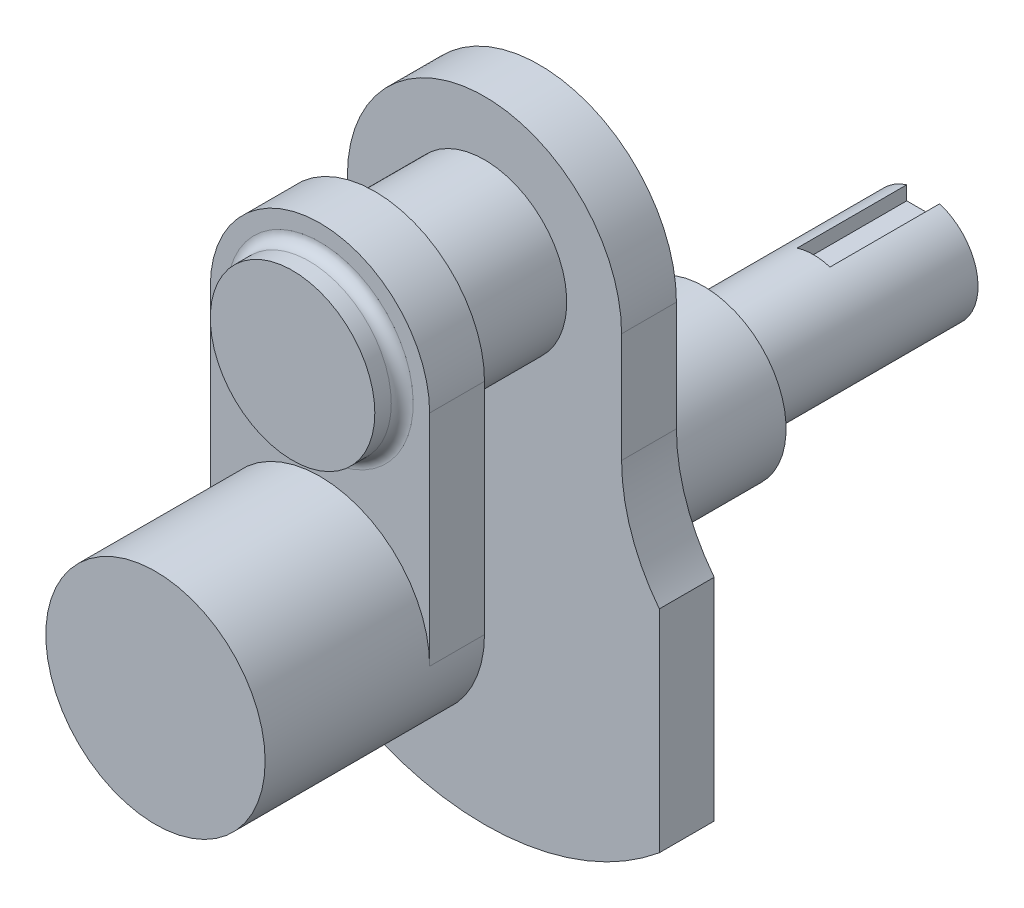
ISO-10303-21;
HEADER;
FILE_DESCRIPTION(('STEP AP214'),'2;1');
FILE_NAME('part.step','',(''),(''),'','','');
FILE_SCHEMA(('AUTOMOTIVE_DESIGN { 1 0 10303 214 1 1 1 1 }'));
ENDSEC;
DATA;
#1=APPLICATION_CONTEXT('core data for automotive mechanical design processes');
#2=APPLICATION_PROTOCOL_DEFINITION('international standard','automotive_design',2000,#1);
#3=PRODUCT_CONTEXT('',#1,'mechanical');
#4=PRODUCT('Part','Part','',(#3));
#5=PRODUCT_RELATED_PRODUCT_CATEGORY('part','',(#4));
#6=PRODUCT_DEFINITION_FORMATION('','',#4);
#7=PRODUCT_DEFINITION_CONTEXT('part definition',#1,'design');
#8=PRODUCT_DEFINITION('design','',#6,#7);
#9=PRODUCT_DEFINITION_SHAPE('','',#8);
#10=(LENGTH_UNIT() NAMED_UNIT(*) SI_UNIT(.MILLI.,.METRE.));
#11=(NAMED_UNIT(*) PLANE_ANGLE_UNIT() SI_UNIT($,.RADIAN.));
#12=(NAMED_UNIT(*) SI_UNIT($,.STERADIAN.) SOLID_ANGLE_UNIT());
#13=UNCERTAINTY_MEASURE_WITH_UNIT(LENGTH_MEASURE(1.E-05),#10,'distance_accuracy_value','');
#14=(GEOMETRIC_REPRESENTATION_CONTEXT(3) GLOBAL_UNCERTAINTY_ASSIGNED_CONTEXT((#13)) GLOBAL_UNIT_ASSIGNED_CONTEXT((#10,
#11,#12)) REPRESENTATION_CONTEXT('',''));
#15=CARTESIAN_POINT('',(0.,0.,0.));
#16=DIRECTION('',(0.,0.,1.));
#17=DIRECTION('',(1.,0.,0.));
#18=AXIS2_PLACEMENT_3D('',#15,#16,#17);
#19=CARTESIAN_POINT('',(-20.,20.,-120.));
#20=DIRECTION('',(0.,0.,1.));
#21=DIRECTION('',(1.,0.,0.));
#22=AXIS2_PLACEMENT_3D('',#19,#20,#21);
#23=CYLINDRICAL_SURFACE('',#22,10.);
#24=CARTESIAN_POINT('',(-20.,20.,-82.));
#25=DIRECTION('',(0.,0.,-1.));
#26=DIRECTION('',(-1.,0.,0.));
#27=AXIS2_PLACEMENT_3D('',#24,#25,#26);
#28=CIRCLE('',#27,10.);
#29=CARTESIAN_POINT('',(-30.,20.,-82.));
#30=VERTEX_POINT('',#29);
#31=EDGE_CURVE('E92',#30,#30,#28,.T.);
#32=ORIENTED_EDGE('',*,*,#31,.T.);
#33=EDGE_LOOP('',(#32));
#34=FACE_BOUND('',#33,.T.);
#35=DIRECTION('',(0.,0.,-1.));
#36=VECTOR('',#35,1.);
#37=CARTESIAN_POINT('',(-17.,29.5393920141695,-100.));
#38=LINE('',#37,#36);
#39=CARTESIAN_POINT('',(-17.,29.5393920141695,-100.));
#40=VERTEX_POINT('',#39);
#41=CARTESIAN_POINT('',(-17.,29.5393920141695,-120.));
#42=VERTEX_POINT('',#41);
#43=EDGE_CURVE('E238',#40,#42,#38,.T.);
#44=ORIENTED_EDGE('',*,*,#43,.F.);
#45=CARTESIAN_POINT('',(-20.,20.,-100.));
#46=DIRECTION('',(0.,0.,-1.));
#47=DIRECTION('',(-1.,0.,0.));
#48=AXIS2_PLACEMENT_3D('',#45,#46,#47);
#49=CIRCLE('',#48,10.);
#50=CARTESIAN_POINT('',(-23.,29.5393920141695,-100.));
#51=VERTEX_POINT('',#50);
#52=EDGE_CURVE('E214',#51,#40,#49,.T.);
#53=ORIENTED_EDGE('',*,*,#52,.F.);
#54=DIRECTION('',(0.,0.,-1.));
#55=VECTOR('',#54,1.);
#56=CARTESIAN_POINT('',(-23.,29.5393920141695,-100.));
#57=LINE('',#56,#55);
#58=CARTESIAN_POINT('',(-23.,29.5393920141695,-120.));
#59=VERTEX_POINT('',#58);
#60=EDGE_CURVE('E203',#51,#59,#57,.T.);
#61=ORIENTED_EDGE('',*,*,#60,.T.);
#62=CARTESIAN_POINT('',(-20.,20.,-120.));
#63=DIRECTION('',(0.,0.,-1.));
#64=DIRECTION('',(-1.,0.,0.));
#65=AXIS2_PLACEMENT_3D('',#62,#63,#64);
#66=CIRCLE('',#65,10.);
#67=EDGE_CURVE('E247',#42,#59,#66,.T.);
#68=ORIENTED_EDGE('',*,*,#67,.F.);
#69=EDGE_LOOP('',(#44,#53,#61,#68));
#70=FACE_BOUND('',#69,.T.);
#71=ADVANCED_FACE('F83',(#34,#70),#23,.T.);
#72=CARTESIAN_POINT('',(-20.,20.,-120.));
#73=DIRECTION('',(0.,0.,-1.));
#74=DIRECTION('',(-1.,0.,0.));
#75=AXIS2_PLACEMENT_3D('',#72,#73,#74);
#76=PLANE('',#75);
#77=CARTESIAN_POINT('',(-20.,20.,-120.));
#78=DIRECTION('',(0.,0.,-1.));
#79=DIRECTION('',(-1.,0.,0.));
#80=AXIS2_PLACEMENT_3D('',#77,#78,#79);
#81=CIRCLE('',#80,1.);
#82=CARTESIAN_POINT('',(-21.,20.,-120.));
#83=VERTEX_POINT('',#82);
#84=EDGE_CURVE('E237',#83,#83,#81,.T.);
#85=ORIENTED_EDGE('',*,*,#84,.F.);
#86=EDGE_LOOP('',(#85));
#87=FACE_BOUND('',#86,.T.);
#88=DIRECTION('',(-1.,0.,0.));
#89=VECTOR('',#88,1.);
#90=CARTESIAN_POINT('',(0.,27.,-120.));
#91=LINE('',#90,#89);
#92=CARTESIAN_POINT('',(-17.,27.,-120.));
#93=VERTEX_POINT('',#92);
#94=CARTESIAN_POINT('',(-23.,27.,-120.));
#95=VERTEX_POINT('',#94);
#96=EDGE_CURVE('E99',#93,#95,#91,.T.);
#97=ORIENTED_EDGE('',*,*,#96,.F.);
#98=DIRECTION('',(0.,1.,0.));
#99=VECTOR('',#98,1.);
#100=CARTESIAN_POINT('',(-17.,0.,-120.));
#101=LINE('',#100,#99);
#102=EDGE_CURVE('E219',#93,#42,#101,.T.);
#103=ORIENTED_EDGE('',*,*,#102,.T.);
#104=ORIENTED_EDGE('',*,*,#67,.T.);
#105=DIRECTION('',(0.,1.,0.));
#106=VECTOR('',#105,1.);
#107=CARTESIAN_POINT('',(-23.,0.,-120.));
#108=LINE('',#107,#106);
#109=EDGE_CURVE('E223',#95,#59,#108,.T.);
#110=ORIENTED_EDGE('',*,*,#109,.F.);
#111=EDGE_LOOP('',(#97,#103,#104,#110));
#112=FACE_BOUND('',#111,.T.);
#113=ADVANCED_FACE('F433',(#87,#112),#76,.T.);
#114=CARTESIAN_POINT('',(-20.,60.,-40.));
#115=DIRECTION('',(0.,0.,1.));
#116=DIRECTION('',(1.,0.,0.));
#117=AXIS2_PLACEMENT_3D('',#114,#115,#116);
#118=CYLINDRICAL_SURFACE('',#117,15.);
#119=CARTESIAN_POINT('',(-20.,60.,-20.));
#120=DIRECTION('',(0.,0.,-1.));
#121=DIRECTION('',(-1.,0.,0.));
#122=AXIS2_PLACEMENT_3D('',#119,#120,#121);
#123=CIRCLE('',#122,15.);
#124=CARTESIAN_POINT('',(-35.,60.,-20.));
#125=VERTEX_POINT('',#124);
#126=EDGE_CURVE('E349',#125,#125,#123,.T.);
#127=ORIENTED_EDGE('',*,*,#126,.T.);
#128=EDGE_LOOP('',(#127));
#129=FACE_BOUND('',#128,.T.);
#130=CARTESIAN_POINT('',(-20.,60.,-40.));
#131=DIRECTION('',(0.,0.,-1.));
#132=DIRECTION('',(-1.,0.,0.));
#133=AXIS2_PLACEMENT_3D('',#130,#131,#132);
#134=CIRCLE('',#133,15.);
#135=CARTESIAN_POINT('',(-35.,60.,-40.));
#136=VERTEX_POINT('',#135);
#137=EDGE_CURVE('E264',#136,#136,#134,.T.);
#138=ORIENTED_EDGE('',*,*,#137,.F.);
#139=EDGE_LOOP('',(#138));
#140=FACE_BOUND('',#139,.T.);
#141=ADVANCED_FACE('F438',(#129,#140),#118,.T.);
#142=CARTESIAN_POINT('',(0.,0.,-20.));
#143=DIRECTION('',(0.,0.,-1.));
#144=DIRECTION('',(-1.,0.,0.));
#145=AXIS2_PLACEMENT_3D('',#142,#143,#144);
#146=PLANE('',#145);
#147=ORIENTED_EDGE('',*,*,#126,.F.);
#148=EDGE_LOOP('',(#147));
#149=FACE_BOUND('',#148,.T.);
#150=DIRECTION('',(0.,1.,0.));
#151=VECTOR('',#150,1.);
#152=CARTESIAN_POINT('',(-40.,85.,-20.));
#153=LINE('',#152,#151);
#154=CARTESIAN_POINT('',(-40.,20.,-20.));
#155=VERTEX_POINT('',#154);
#156=CARTESIAN_POINT('',(-40.,60.,-20.));
#157=VERTEX_POINT('',#156);
#158=EDGE_CURVE('E368',#155,#157,#153,.T.);
#159=ORIENTED_EDGE('',*,*,#158,.T.);
#160=CARTESIAN_POINT('',(-20.,60.,-20.));
#161=DIRECTION('',(0.,0.,-1.));
#162=DIRECTION('',(-1.,0.,0.));
#163=AXIS2_PLACEMENT_3D('',#160,#161,#162);
#164=CIRCLE('',#163,20.);
#165=CARTESIAN_POINT('',(0.,60.,-20.));
#166=VERTEX_POINT('',#165);
#167=EDGE_CURVE('E360',#157,#166,#164,.T.);
#168=ORIENTED_EDGE('',*,*,#167,.T.);
#169=DIRECTION('',(0.,1.,0.));
#170=VECTOR('',#169,1.);
#171=CARTESIAN_POINT('',(0.,85.,-20.));
#172=LINE('',#171,#170);
#173=CARTESIAN_POINT('',(0.,20.,-20.));
#174=VERTEX_POINT('',#173);
#175=EDGE_CURVE('E380',#174,#166,#172,.T.);
#176=ORIENTED_EDGE('',*,*,#175,.F.);
#177=CARTESIAN_POINT('',(-20.,20.,-20.));
#178=DIRECTION('',(0.,0.,1.));
#179=DIRECTION('',(1.,0.,0.));
#180=AXIS2_PLACEMENT_3D('',#177,#178,#179);
#181=CIRCLE('',#180,20.);
#182=EDGE_CURVE('E386',#155,#174,#181,.T.);
#183=ORIENTED_EDGE('',*,*,#182,.F.);
#184=EDGE_LOOP('',(#159,#168,#176,#183));
#185=FACE_BOUND('',#184,.T.);
#186=ADVANCED_FACE('F514',(#149,#185),#146,.T.);
#187=CARTESIAN_POINT('',(-40.,20.,-10.));
#188=DIRECTION('',(0.,0.,1.));
#189=DIRECTION('',(0.,-1.,0.));
#190=AXIS2_PLACEMENT_3D('',#187,#188,#189);
#191=PLANE('',#190);
#192=CARTESIAN_POINT('',(-20.,60.,-10.));
#193=DIRECTION('',(0.,0.,1.));
#194=DIRECTION('',(0.,-1.,0.));
#195=AXIS2_PLACEMENT_3D('',#192,#193,#194);
#196=CIRCLE('',#195,17.);
#197=CARTESIAN_POINT('',(-20.,43.,-10.));
#198=VERTEX_POINT('',#197);
#199=EDGE_CURVE('E401',#198,#198,#196,.F.);
#200=ORIENTED_EDGE('',*,*,#199,.T.);
#201=EDGE_LOOP('',(#200));
#202=FACE_BOUND('',#201,.T.);
#203=DIRECTION('',(0.,-1.,0.));
#204=VECTOR('',#203,1.);
#205=CARTESIAN_POINT('',(0.,20.,-10.));
#206=LINE('',#205,#204);
#207=CARTESIAN_POINT('',(0.,60.,-10.));
#208=VERTEX_POINT('',#207);
#209=CARTESIAN_POINT('',(0.,20.,-10.));
#210=VERTEX_POINT('',#209);
#211=EDGE_CURVE('E369',#208,#210,#206,.T.);
#212=ORIENTED_EDGE('',*,*,#211,.F.);
#213=CARTESIAN_POINT('',(-20.,60.,-10.));
#214=DIRECTION('',(0.,0.,1.));
#215=DIRECTION('',(1.,0.,0.));
#216=AXIS2_PLACEMENT_3D('',#213,#214,#215);
#217=CIRCLE('',#216,20.);
#218=CARTESIAN_POINT('',(-40.,60.,-10.));
#219=VERTEX_POINT('',#218);
#220=EDGE_CURVE('E107',#208,#219,#217,.T.);
#221=ORIENTED_EDGE('',*,*,#220,.T.);
#222=DIRECTION('',(0.,-1.,0.));
#223=VECTOR('',#222,1.);
#224=CARTESIAN_POINT('',(-40.,20.,-10.));
#225=LINE('',#224,#223);
#226=CARTESIAN_POINT('',(-40.,20.,-10.));
#227=VERTEX_POINT('',#226);
#228=EDGE_CURVE('E373',#219,#227,#225,.T.);
#229=ORIENTED_EDGE('',*,*,#228,.T.);
#230=CARTESIAN_POINT('',(-20.,20.,-10.));
#231=DIRECTION('',(0.,0.,1.));
#232=DIRECTION('',(0.,-1.,0.));
#233=AXIS2_PLACEMENT_3D('',#230,#231,#232);
#234=CIRCLE('',#233,20.);
#235=EDGE_CURVE('E389',#227,#210,#234,.F.);
#236=ORIENTED_EDGE('',*,*,#235,.T.);
#237=EDGE_LOOP('',(#212,#221,#229,#236));
#238=FACE_BOUND('',#237,.T.);
#239=ADVANCED_FACE('F510',(#202,#238),#191,.T.);
#240=CARTESIAN_POINT('',(0.,0.,20.));
#241=DIRECTION('',(0.,0.,-1.));
#242=DIRECTION('',(-1.,0.,0.));
#243=AXIS2_PLACEMENT_3D('',#240,#241,#242);
#244=PLANE('',#243);
#245=CARTESIAN_POINT('',(-20.,20.,20.));
#246=DIRECTION('',(0.,0.,1.));
#247=DIRECTION('',(1.,0.,0.));
#248=AXIS2_PLACEMENT_3D('',#245,#246,#247);
#249=CIRCLE('',#248,20.);
#250=CARTESIAN_POINT('',(0.,20.,20.));
#251=VERTEX_POINT('',#250);
#252=EDGE_CURVE('E376',#251,#251,#249,.T.);
#253=ORIENTED_EDGE('',*,*,#252,.T.);
#254=EDGE_LOOP('',(#253));
#255=FACE_BOUND('',#254,.T.);
#256=ADVANCED_FACE('F513',(#255),#244,.F.);
#257=CARTESIAN_POINT('',(-20.,20.,-20.));
#258=DIRECTION('',(0.,0.,1.));
#259=DIRECTION('',(1.,0.,0.));
#260=AXIS2_PLACEMENT_3D('',#257,#258,#259);
#261=CYLINDRICAL_SURFACE('',#260,20.);
#262=DIRECTION('',(0.,0.,-1.));
#263=VECTOR('',#262,1.);
#264=CARTESIAN_POINT('',(-40.,20.,-10.));
#265=LINE('',#264,#263);
#266=EDGE_CURVE('E365',#227,#155,#265,.T.);
#267=ORIENTED_EDGE('',*,*,#266,.T.);
#268=ORIENTED_EDGE('',*,*,#182,.T.);
#269=DIRECTION('',(0.,0.,-1.));
#270=VECTOR('',#269,1.);
#271=CARTESIAN_POINT('',(0.,20.,-10.));
#272=LINE('',#271,#270);
#273=EDGE_CURVE('E364',#210,#174,#272,.T.);
#274=ORIENTED_EDGE('',*,*,#273,.F.);
#275=ORIENTED_EDGE('',*,*,#235,.F.);
#276=EDGE_LOOP('',(#267,#268,#274,#275));
#277=FACE_BOUND('',#276,.T.);
#278=ORIENTED_EDGE('',*,*,#252,.F.);
#279=EDGE_LOOP('',(#278));
#280=FACE_BOUND('',#279,.T.);
#281=ADVANCED_FACE('F505',(#277,#280),#261,.T.);
#282=CARTESIAN_POINT('',(-40.,0.,0.));
#283=DIRECTION('',(-1.,0.,0.));
#284=DIRECTION('',(0.,0.,1.));
#285=AXIS2_PLACEMENT_3D('',#282,#283,#284);
#286=PLANE('',#285);
#287=DIRECTION('',(0.,0.,1.));
#288=VECTOR('',#287,1.);
#289=CARTESIAN_POINT('',(-40.,60.,-50.));
#290=LINE('',#289,#288);
#291=EDGE_CURVE('E357',#157,#219,#290,.T.);
#292=ORIENTED_EDGE('',*,*,#291,.F.);
#293=ORIENTED_EDGE('',*,*,#158,.F.);
#294=ORIENTED_EDGE('',*,*,#266,.F.);
#295=ORIENTED_EDGE('',*,*,#228,.F.);
#296=EDGE_LOOP('',(#292,#293,#294,#295));
#297=FACE_BOUND('',#296,.T.);
#298=ADVANCED_FACE('F502',(#297),#286,.T.);
#299=CARTESIAN_POINT('',(0.,0.,0.));
#300=DIRECTION('',(-1.,0.,0.));
#301=DIRECTION('',(0.,0.,1.));
#302=AXIS2_PLACEMENT_3D('',#299,#300,#301);
#303=PLANE('',#302);
#304=ORIENTED_EDGE('',*,*,#175,.T.);
#305=DIRECTION('',(0.,0.,1.));
#306=VECTOR('',#305,1.);
#307=CARTESIAN_POINT('',(0.,60.,-50.));
#308=LINE('',#307,#306);
#309=EDGE_CURVE('E354',#166,#208,#308,.T.);
#310=ORIENTED_EDGE('',*,*,#309,.T.);
#311=ORIENTED_EDGE('',*,*,#211,.T.);
#312=ORIENTED_EDGE('',*,*,#273,.T.);
#313=EDGE_LOOP('',(#304,#310,#311,#312));
#314=FACE_BOUND('',#313,.T.);
#315=ADVANCED_FACE('F501',(#314),#303,.F.);
#316=CARTESIAN_POINT('',(-20.,60.,-50.));
#317=DIRECTION('',(0.,0.,1.));
#318=DIRECTION('',(1.,0.,0.));
#319=AXIS2_PLACEMENT_3D('',#316,#317,#318);
#320=CYLINDRICAL_SURFACE('',#319,20.);
#321=ORIENTED_EDGE('',*,*,#291,.T.);
#322=ORIENTED_EDGE('',*,*,#220,.F.);
#323=ORIENTED_EDGE('',*,*,#309,.F.);
#324=ORIENTED_EDGE('',*,*,#167,.F.);
#325=EDGE_LOOP('',(#321,#322,#323,#324));
#326=FACE_BOUND('',#325,.T.);
#327=ADVANCED_FACE('F494',(#326),#320,.T.);
#328=CARTESIAN_POINT('',(-20.,60.,-5.));
#329=DIRECTION('',(0.,0.,1.));
#330=DIRECTION('',(1.,0.,0.));
#331=AXIS2_PLACEMENT_3D('',#328,#329,#330);
#332=PLANE('',#331);
#333=CARTESIAN_POINT('',(-20.,60.,-5.));
#334=DIRECTION('',(0.,0.,1.));
#335=DIRECTION('',(1.,0.,0.));
#336=AXIS2_PLACEMENT_3D('',#333,#334,#335);
#337=CIRCLE('',#336,15.);
#338=CARTESIAN_POINT('',(-5.,60.,-5.));
#339=VERTEX_POINT('',#338);
#340=EDGE_CURVE('E345',#339,#339,#337,.T.);
#341=ORIENTED_EDGE('',*,*,#340,.T.);
#342=EDGE_LOOP('',(#341));
#343=FACE_BOUND('',#342,.T.);
#344=ADVANCED_FACE('F490',(#343),#332,.T.);
#345=CARTESIAN_POINT('',(-20.,60.,-8.));
#346=DIRECTION('',(0.,0.,1.));
#347=DIRECTION('',(0.,-1.,0.));
#348=AXIS2_PLACEMENT_3D('',#345,#346,#347);
#349=CIRCLE('',#348,15.);
#350=CARTESIAN_POINT('',(-20.,45.,-8.));
#351=VERTEX_POINT('',#350);
#352=EDGE_CURVE('E353',#351,#351,#349,.T.);
#353=ORIENTED_EDGE('',*,*,#352,.T.);
#354=EDGE_LOOP('',(#353));
#355=FACE_BOUND('',#354,.T.);
#356=ORIENTED_EDGE('',*,*,#340,.F.);
#357=EDGE_LOOP('',(#356));
#358=FACE_BOUND('',#357,.T.);
#359=ADVANCED_FACE('F493',(#355,#358),#118,.T.);
#360=CARTESIAN_POINT('',(-20.,60.,-8.));
#361=DIRECTION('',(0.,0.,1.));
#362=DIRECTION('',(0.,-1.,0.));
#363=AXIS2_PLACEMENT_3D('',#360,#361,#362);
#364=TOROIDAL_SURFACE('',#363,17.,2.);
#365=ORIENTED_EDGE('',*,*,#199,.F.);
#366=EDGE_LOOP('',(#365));
#367=FACE_BOUND('',#366,.T.);
#368=ORIENTED_EDGE('',*,*,#352,.F.);
#369=EDGE_LOOP('',(#368));
#370=FACE_BOUND('',#369,.T.);
#371=ADVANCED_FACE('F485',(#367,#370),#364,.F.);
#372=CARTESIAN_POINT('',(-45.,0.,-50.));
#373=DIRECTION('',(-1.,0.,0.));
#374=DIRECTION('',(0.,0.,1.));
#375=AXIS2_PLACEMENT_3D('',#372,#373,#374);
#376=PLANE('',#375);
#377=DIRECTION('',(0.,-1.,0.));
#378=VECTOR('',#377,1.);
#379=CARTESIAN_POINT('',(-45.,0.,-40.));
#380=LINE('',#379,#378);
#381=CARTESIAN_POINT('',(-45.,60.,-40.));
#382=VERTEX_POINT('',#381);
#383=CARTESIAN_POINT('',(-45.,40.,-40.));
#384=VERTEX_POINT('',#383);
#385=EDGE_CURVE('E258',#382,#384,#380,.T.);
#386=ORIENTED_EDGE('',*,*,#385,.F.);
#387=DIRECTION('',(0.,0.,1.));
#388=VECTOR('',#387,1.);
#389=CARTESIAN_POINT('',(-45.,60.,-50.));
#390=LINE('',#389,#388);
#391=CARTESIAN_POINT('',(-45.,60.,-50.));
#392=VERTEX_POINT('',#391);
#393=EDGE_CURVE('E342',#392,#382,#390,.T.);
#394=ORIENTED_EDGE('',*,*,#393,.F.);
#395=DIRECTION('',(0.,-1.,0.));
#396=VECTOR('',#395,1.);
#397=CARTESIAN_POINT('',(-45.,0.,-50.));
#398=LINE('',#397,#396);
#399=CARTESIAN_POINT('',(-45.,40.,-50.));
#400=VERTEX_POINT('',#399);
#401=EDGE_CURVE('E259',#392,#400,#398,.T.);
#402=ORIENTED_EDGE('',*,*,#401,.T.);
#403=DIRECTION('',(0.,0.,1.));
#404=VECTOR('',#403,1.);
#405=CARTESIAN_POINT('',(-45.,40.,-50.));
#406=LINE('',#405,#404);
#407=EDGE_CURVE('E287',#400,#384,#406,.T.);
#408=ORIENTED_EDGE('',*,*,#407,.T.);
#409=EDGE_LOOP('',(#386,#394,#402,#408));
#410=FACE_BOUND('',#409,.T.);
#411=ADVANCED_FACE('F481',(#410),#376,.T.);
#412=CARTESIAN_POINT('',(-20.,60.,-50.));
#413=DIRECTION('',(0.,0.,1.));
#414=DIRECTION('',(1.,0.,0.));
#415=AXIS2_PLACEMENT_3D('',#412,#413,#414);
#416=CYLINDRICAL_SURFACE('',#415,25.);
#417=CARTESIAN_POINT('',(-20.,60.,-40.));
#418=DIRECTION('',(0.,0.,-1.));
#419=DIRECTION('',(-1.,0.,0.));
#420=AXIS2_PLACEMENT_3D('',#417,#418,#419);
#421=CIRCLE('',#420,25.);
#422=CARTESIAN_POINT('',(4.99999999999999,60.,-40.));
#423=VERTEX_POINT('',#422);
#424=EDGE_CURVE('E291',#382,#423,#421,.T.);
#425=ORIENTED_EDGE('',*,*,#424,.T.);
#426=DIRECTION('',(0.,0.,1.));
#427=VECTOR('',#426,1.);
#428=CARTESIAN_POINT('',(4.99999999999999,60.,-50.));
#429=LINE('',#428,#427);
#430=CARTESIAN_POINT('',(4.99999999999999,60.,-50.));
#431=VERTEX_POINT('',#430);
#432=EDGE_CURVE('E338',#431,#423,#429,.T.);
#433=ORIENTED_EDGE('',*,*,#432,.F.);
#434=CARTESIAN_POINT('',(-20.,60.,-50.));
#435=DIRECTION('',(0.,0.,-1.));
#436=DIRECTION('',(-1.,0.,0.));
#437=AXIS2_PLACEMENT_3D('',#434,#435,#436);
#438=CIRCLE('',#437,25.);
#439=EDGE_CURVE('E263',#392,#431,#438,.T.);
#440=ORIENTED_EDGE('',*,*,#439,.F.);
#441=ORIENTED_EDGE('',*,*,#393,.T.);
#442=EDGE_LOOP('',(#425,#433,#440,#441));
#443=FACE_BOUND('',#442,.T.);
#444=ADVANCED_FACE('F477',(#443),#416,.T.);
#445=CARTESIAN_POINT('',(5.00000000000001,0.,-50.));
#446=DIRECTION('',(-1.,0.,0.));
#447=DIRECTION('',(0.,-1.,0.));
#448=AXIS2_PLACEMENT_3D('',#445,#446,#447);
#449=PLANE('',#448);
#450=DIRECTION('',(0.,-1.,0.));
#451=VECTOR('',#450,1.);
#452=CARTESIAN_POINT('',(5.00000000000001,0.,-40.));
#453=LINE('',#452,#451);
#454=CARTESIAN_POINT('',(5.,40.,-40.));
#455=VERTEX_POINT('',#454);
#456=EDGE_CURVE('E294',#423,#455,#453,.T.);
#457=ORIENTED_EDGE('',*,*,#456,.T.);
#458=DIRECTION('',(0.,0.,1.));
#459=VECTOR('',#458,1.);
#460=CARTESIAN_POINT('',(5.,40.,-50.));
#461=LINE('',#460,#459);
#462=CARTESIAN_POINT('',(5.,40.,-50.));
#463=VERTEX_POINT('',#462);
#464=EDGE_CURVE('E335',#463,#455,#461,.T.);
#465=ORIENTED_EDGE('',*,*,#464,.F.);
#466=DIRECTION('',(0.,-1.,0.));
#467=VECTOR('',#466,1.);
#468=CARTESIAN_POINT('',(5.00000000000001,0.,-50.));
#469=LINE('',#468,#467);
#470=EDGE_CURVE('E267',#431,#463,#469,.T.);
#471=ORIENTED_EDGE('',*,*,#470,.F.);
#472=ORIENTED_EDGE('',*,*,#432,.T.);
#473=EDGE_LOOP('',(#457,#465,#471,#472));
#474=FACE_BOUND('',#473,.T.);
#475=ADVANCED_FACE('F473',(#474),#449,.F.);
#476=CARTESIAN_POINT('',(37.5,40.,-50.));
#477=DIRECTION('',(0.,0.,1.));
#478=DIRECTION('',(1.,0.,0.));
#479=AXIS2_PLACEMENT_3D('',#476,#477,#478);
#480=CYLINDRICAL_SURFACE('',#479,32.5);
#481=CARTESIAN_POINT('',(37.5,40.,-40.));
#482=DIRECTION('',(0.,0.,-1.));
#483=DIRECTION('',(-1.,0.,0.));
#484=AXIS2_PLACEMENT_3D('',#481,#482,#483);
#485=CIRCLE('',#484,32.5);
#486=CARTESIAN_POINT('',(11.882623085101,20.,-40.));
#487=VERTEX_POINT('',#486);
#488=EDGE_CURVE('E298',#487,#455,#485,.T.);
#489=ORIENTED_EDGE('',*,*,#488,.F.);
#490=DIRECTION('',(0.,0.,1.));
#491=VECTOR('',#490,1.);
#492=CARTESIAN_POINT('',(11.882623085101,20.,-50.));
#493=LINE('',#492,#491);
#494=CARTESIAN_POINT('',(11.882623085101,20.,-50.));
#495=VERTEX_POINT('',#494);
#496=EDGE_CURVE('E332',#495,#487,#493,.T.);
#497=ORIENTED_EDGE('',*,*,#496,.F.);
#498=CARTESIAN_POINT('',(37.5,40.,-50.));
#499=DIRECTION('',(0.,0.,-1.));
#500=DIRECTION('',(-1.,0.,0.));
#501=AXIS2_PLACEMENT_3D('',#498,#499,#500);
#502=CIRCLE('',#501,32.5);
#503=EDGE_CURVE('E270',#495,#463,#502,.T.);
#504=ORIENTED_EDGE('',*,*,#503,.T.);
#505=ORIENTED_EDGE('',*,*,#464,.T.);
#506=EDGE_LOOP('',(#489,#497,#504,#505));
#507=FACE_BOUND('',#506,.T.);
#508=ADVANCED_FACE('F469',(#507),#480,.F.);
#509=CARTESIAN_POINT('',(11.882623085101,0.,-50.));
#510=DIRECTION('',(-1.,0.,0.));
#511=DIRECTION('',(0.,0.,1.));
#512=AXIS2_PLACEMENT_3D('',#509,#510,#511);
#513=PLANE('',#512);
#514=DIRECTION('',(0.,-1.,0.));
#515=VECTOR('',#514,1.);
#516=CARTESIAN_POINT('',(11.882623085101,0.,-40.));
#517=LINE('',#516,#515);
#518=CARTESIAN_POINT('',(11.882623085101,-18.5162088634562,-40.));
#519=VERTEX_POINT('',#518);
#520=EDGE_CURVE('E302',#487,#519,#517,.T.);
#521=ORIENTED_EDGE('',*,*,#520,.T.);
#522=DIRECTION('',(0.,0.,1.));
#523=VECTOR('',#522,1.);
#524=CARTESIAN_POINT('',(11.882623085101,-18.5162088634562,-50.));
#525=LINE('',#524,#523);
#526=CARTESIAN_POINT('',(11.882623085101,-18.5162088634562,-50.));
#527=VERTEX_POINT('',#526);
#528=EDGE_CURVE('E328',#527,#519,#525,.T.);
#529=ORIENTED_EDGE('',*,*,#528,.F.);
#530=DIRECTION('',(0.,-1.,0.));
#531=VECTOR('',#530,1.);
#532=CARTESIAN_POINT('',(11.882623085101,0.,-50.));
#533=LINE('',#532,#531);
#534=EDGE_CURVE('E274',#495,#527,#533,.T.);
#535=ORIENTED_EDGE('',*,*,#534,.F.);
#536=ORIENTED_EDGE('',*,*,#496,.T.);
#537=EDGE_LOOP('',(#521,#529,#535,#536));
#538=FACE_BOUND('',#537,.T.);
#539=ADVANCED_FACE('F465',(#538),#513,.F.);
#540=CARTESIAN_POINT('',(-20.,20.,-50.));
#541=DIRECTION('',(0.,0.,1.));
#542=DIRECTION('',(1.,0.,0.));
#543=AXIS2_PLACEMENT_3D('',#540,#541,#542);
#544=CYLINDRICAL_SURFACE('',#543,50.);
#545=CARTESIAN_POINT('',(-20.,20.,-40.));
#546=DIRECTION('',(0.,0.,-1.));
#547=DIRECTION('',(-1.,0.,0.));
#548=AXIS2_PLACEMENT_3D('',#545,#546,#547);
#549=CIRCLE('',#548,50.);
#550=CARTESIAN_POINT('',(-51.882623085101,-18.5162088634562,-40.));
#551=VERTEX_POINT('',#550);
#552=EDGE_CURVE('E305',#519,#551,#549,.T.);
#553=ORIENTED_EDGE('',*,*,#552,.T.);
#554=DIRECTION('',(0.,0.,1.));
#555=VECTOR('',#554,1.);
#556=CARTESIAN_POINT('',(-51.882623085101,-18.5162088634562,-50.));
#557=LINE('',#556,#555);
#558=CARTESIAN_POINT('',(-51.882623085101,-18.5162088634562,-50.));
#559=VERTEX_POINT('',#558);
#560=EDGE_CURVE('E325',#559,#551,#557,.T.);
#561=ORIENTED_EDGE('',*,*,#560,.F.);
#562=CARTESIAN_POINT('',(-20.,20.,-50.));
#563=DIRECTION('',(0.,0.,-1.));
#564=DIRECTION('',(-1.,0.,0.));
#565=AXIS2_PLACEMENT_3D('',#562,#563,#564);
#566=CIRCLE('',#565,50.);
#567=EDGE_CURVE('E277',#527,#559,#566,.T.);
#568=ORIENTED_EDGE('',*,*,#567,.F.);
#569=ORIENTED_EDGE('',*,*,#528,.T.);
#570=EDGE_LOOP('',(#553,#561,#568,#569));
#571=FACE_BOUND('',#570,.T.);
#572=ADVANCED_FACE('F461',(#571),#544,.T.);
#573=CARTESIAN_POINT('',(-51.882623085101,0.,-50.));
#574=DIRECTION('',(-1.,0.,0.));
#575=DIRECTION('',(0.,0.,1.));
#576=AXIS2_PLACEMENT_3D('',#573,#574,#575);
#577=PLANE('',#576);
#578=DIRECTION('',(0.,-1.,0.));
#579=VECTOR('',#578,1.);
#580=CARTESIAN_POINT('',(-51.882623085101,0.,-40.));
#581=LINE('',#580,#579);
#582=CARTESIAN_POINT('',(-51.882623085101,20.,-40.));
#583=VERTEX_POINT('',#582);
#584=EDGE_CURVE('E309',#583,#551,#581,.T.);
#585=ORIENTED_EDGE('',*,*,#584,.F.);
#586=DIRECTION('',(0.,0.,1.));
#587=VECTOR('',#586,1.);
#588=CARTESIAN_POINT('',(-51.882623085101,20.,-50.));
#589=LINE('',#588,#587);
#590=CARTESIAN_POINT('',(-51.882623085101,20.,-50.));
#591=VERTEX_POINT('',#590);
#592=EDGE_CURVE('E322',#591,#583,#589,.T.);
#593=ORIENTED_EDGE('',*,*,#592,.F.);
#594=DIRECTION('',(0.,-1.,0.));
#595=VECTOR('',#594,1.);
#596=CARTESIAN_POINT('',(-51.882623085101,0.,-50.));
#597=LINE('',#596,#595);
#598=EDGE_CURVE('E280',#591,#559,#597,.T.);
#599=ORIENTED_EDGE('',*,*,#598,.T.);
#600=ORIENTED_EDGE('',*,*,#560,.T.);
#601=EDGE_LOOP('',(#585,#593,#599,#600));
#602=FACE_BOUND('',#601,.T.);
#603=ADVANCED_FACE('F457',(#602),#577,.T.);
#604=CARTESIAN_POINT('',(-77.5,40.,-50.));
#605=DIRECTION('',(0.,0.,1.));
#606=DIRECTION('',(1.,0.,0.));
#607=AXIS2_PLACEMENT_3D('',#604,#605,#606);
#608=CYLINDRICAL_SURFACE('',#607,32.5);
#609=CARTESIAN_POINT('',(-77.5,40.,-40.));
#610=DIRECTION('',(0.,0.,-1.));
#611=DIRECTION('',(-1.,0.,0.));
#612=AXIS2_PLACEMENT_3D('',#609,#610,#611);
#613=CIRCLE('',#612,32.5);
#614=EDGE_CURVE('E313',#583,#384,#613,.F.);
#615=ORIENTED_EDGE('',*,*,#614,.T.);
#616=ORIENTED_EDGE('',*,*,#407,.F.);
#617=CARTESIAN_POINT('',(-77.5,40.,-50.));
#618=DIRECTION('',(0.,0.,-1.));
#619=DIRECTION('',(-1.,0.,0.));
#620=AXIS2_PLACEMENT_3D('',#617,#618,#619);
#621=CIRCLE('',#620,32.5);
#622=EDGE_CURVE('E284',#591,#400,#621,.F.);
#623=ORIENTED_EDGE('',*,*,#622,.F.);
#624=ORIENTED_EDGE('',*,*,#592,.T.);
#625=EDGE_LOOP('',(#615,#616,#623,#624));
#626=FACE_BOUND('',#625,.T.);
#627=ADVANCED_FACE('F453',(#626),#608,.F.);
#628=CARTESIAN_POINT('',(0.,0.,-40.));
#629=DIRECTION('',(0.,0.,-1.));
#630=DIRECTION('',(-1.,0.,0.));
#631=AXIS2_PLACEMENT_3D('',#628,#629,#630);
#632=PLANE('',#631);
#633=ORIENTED_EDGE('',*,*,#385,.T.);
#634=ORIENTED_EDGE('',*,*,#614,.F.);
#635=ORIENTED_EDGE('',*,*,#584,.T.);
#636=ORIENTED_EDGE('',*,*,#552,.F.);
#637=ORIENTED_EDGE('',*,*,#520,.F.);
#638=ORIENTED_EDGE('',*,*,#488,.T.);
#639=ORIENTED_EDGE('',*,*,#456,.F.);
#640=ORIENTED_EDGE('',*,*,#424,.F.);
#641=EDGE_LOOP('',(#633,#634,#635,#636,#637,#638,#639,#640));
#642=FACE_BOUND('',#641,.T.);
#643=ORIENTED_EDGE('',*,*,#137,.T.);
#644=EDGE_LOOP('',(#643));
#645=FACE_BOUND('',#644,.T.);
#646=ADVANCED_FACE('F450',(#642,#645),#632,.F.);
#647=CARTESIAN_POINT('',(0.,0.,-50.));
#648=DIRECTION('',(0.,0.,-1.));
#649=DIRECTION('',(-1.,0.,0.));
#650=AXIS2_PLACEMENT_3D('',#647,#648,#649);
#651=PLANE('',#650);
#652=CARTESIAN_POINT('',(-20.,20.,-50.));
#653=DIRECTION('',(0.,0.,-1.));
#654=DIRECTION('',(-1.,0.,0.));
#655=AXIS2_PLACEMENT_3D('',#652,#653,#654);
#656=CIRCLE('',#655,17.);
#657=CARTESIAN_POINT('',(-37.,20.,-50.));
#658=VERTEX_POINT('',#657);
#659=EDGE_CURVE('E409',#658,#658,#656,.F.);
#660=ORIENTED_EDGE('',*,*,#659,.T.);
#661=EDGE_LOOP('',(#660));
#662=FACE_BOUND('',#661,.T.);
#663=ORIENTED_EDGE('',*,*,#401,.F.);
#664=ORIENTED_EDGE('',*,*,#439,.T.);
#665=ORIENTED_EDGE('',*,*,#470,.T.);
#666=ORIENTED_EDGE('',*,*,#503,.F.);
#667=ORIENTED_EDGE('',*,*,#534,.T.);
#668=ORIENTED_EDGE('',*,*,#567,.T.);
#669=ORIENTED_EDGE('',*,*,#598,.F.);
#670=ORIENTED_EDGE('',*,*,#622,.T.);
#671=EDGE_LOOP('',(#663,#664,#665,#666,#667,#668,#669,#670));
#672=FACE_BOUND('',#671,.T.);
#673=ADVANCED_FACE('F448',(#662,#672),#651,.T.);
#674=CARTESIAN_POINT('',(-20.,20.,-80.));
#675=DIRECTION('',(0.,0.,1.));
#676=DIRECTION('',(1.,0.,0.));
#677=AXIS2_PLACEMENT_3D('',#674,#675,#676);
#678=CYLINDRICAL_SURFACE('',#677,15.);
#679=CARTESIAN_POINT('',(-20.,20.,-52.));
#680=DIRECTION('',(0.,0.,-1.));
#681=DIRECTION('',(-1.,0.,0.));
#682=AXIS2_PLACEMENT_3D('',#679,#680,#681);
#683=CIRCLE('',#682,15.);
#684=CARTESIAN_POINT('',(-35.,20.,-52.));
#685=VERTEX_POINT('',#684);
#686=EDGE_CURVE('E405',#685,#685,#683,.T.);
#687=ORIENTED_EDGE('',*,*,#686,.T.);
#688=EDGE_LOOP('',(#687));
#689=FACE_BOUND('',#688,.T.);
#690=CARTESIAN_POINT('',(-20.,20.,-80.));
#691=DIRECTION('',(0.,0.,-1.));
#692=DIRECTION('',(-1.,0.,0.));
#693=AXIS2_PLACEMENT_3D('',#690,#691,#692);
#694=CIRCLE('',#693,15.);
#695=CARTESIAN_POINT('',(-35.,20.,-80.));
#696=VERTEX_POINT('',#695);
#697=EDGE_CURVE('E254',#696,#696,#694,.T.);
#698=ORIENTED_EDGE('',*,*,#697,.F.);
#699=EDGE_LOOP('',(#698));
#700=FACE_BOUND('',#699,.T.);
#701=ADVANCED_FACE('F444',(#689,#700),#678,.T.);
#702=CARTESIAN_POINT('',(-20.,20.,-80.));
#703=DIRECTION('',(0.,0.,-1.));
#704=DIRECTION('',(-1.,0.,0.));
#705=AXIS2_PLACEMENT_3D('',#702,#703,#704);
#706=PLANE('',#705);
#707=CARTESIAN_POINT('',(-20.,20.,-80.));
#708=DIRECTION('',(0.,0.,-1.));
#709=DIRECTION('',(-1.,0.,0.));
#710=AXIS2_PLACEMENT_3D('',#707,#708,#709);
#711=CIRCLE('',#710,12.);
#712=CARTESIAN_POINT('',(-32.,20.,-80.));
#713=VERTEX_POINT('',#712);
#714=EDGE_CURVE('E12',#713,#713,#711,.F.);
#715=ORIENTED_EDGE('',*,*,#714,.T.);
#716=EDGE_LOOP('',(#715));
#717=FACE_BOUND('',#716,.T.);
#718=ORIENTED_EDGE('',*,*,#697,.T.);
#719=EDGE_LOOP('',(#718));
#720=FACE_BOUND('',#719,.T.);
#721=ADVANCED_FACE('F429',(#717,#720),#706,.T.);
#722=CARTESIAN_POINT('',(-20.,20.,-52.));
#723=DIRECTION('',(0.,0.,-1.));
#724=DIRECTION('',(-1.,0.,0.));
#725=AXIS2_PLACEMENT_3D('',#722,#723,#724);
#726=TOROIDAL_SURFACE('',#725,17.,2.);
#727=ORIENTED_EDGE('',*,*,#659,.F.);
#728=EDGE_LOOP('',(#727));
#729=FACE_BOUND('',#728,.T.);
#730=ORIENTED_EDGE('',*,*,#686,.F.);
#731=EDGE_LOOP('',(#730));
#732=FACE_BOUND('',#731,.T.);
#733=ADVANCED_FACE('F420',(#729,#732),#726,.F.);
#734=CARTESIAN_POINT('',(-20.,20.,-82.));
#735=DIRECTION('',(0.,0.,-1.));
#736=DIRECTION('',(-1.,0.,0.));
#737=AXIS2_PLACEMENT_3D('',#734,#735,#736);
#738=TOROIDAL_SURFACE('',#737,12.,2.);
#739=ORIENTED_EDGE('',*,*,#714,.F.);
#740=EDGE_LOOP('',(#739));
#741=FACE_BOUND('',#740,.T.);
#742=ORIENTED_EDGE('',*,*,#31,.F.);
#743=EDGE_LOOP('',(#742));
#744=FACE_BOUND('',#743,.T.);
#745=ADVANCED_FACE('F85',(#741,#744),#738,.F.);
#746=CARTESIAN_POINT('',(-20.,20.,-100.));
#747=DIRECTION('',(0.,0.,-1.));
#748=DIRECTION('',(-1.,0.,0.));
#749=AXIS2_PLACEMENT_3D('',#746,#747,#748);
#750=CYLINDRICAL_SURFACE('',#749,1.);
#751=CARTESIAN_POINT('',(-20.,20.,-100.));
#752=DIRECTION('',(0.,0.,-1.));
#753=DIRECTION('',(-1.,0.,0.));
#754=AXIS2_PLACEMENT_3D('',#751,#752,#753);
#755=CIRCLE('',#754,1.);
#756=CARTESIAN_POINT('',(-21.,20.,-100.));
#757=VERTEX_POINT('',#756);
#758=EDGE_CURVE('E243',#757,#757,#755,.T.);
#759=ORIENTED_EDGE('',*,*,#758,.F.);
#760=EDGE_LOOP('',(#759));
#761=FACE_BOUND('',#760,.T.);
#762=ORIENTED_EDGE('',*,*,#84,.T.);
#763=EDGE_LOOP('',(#762));
#764=FACE_BOUND('',#763,.T.);
#765=ADVANCED_FACE('F419',(#761,#764),#750,.F.);
#766=CARTESIAN_POINT('',(-20.,20.,-100.));
#767=DIRECTION('',(0.,0.,-1.));
#768=DIRECTION('',(-1.,0.,0.));
#769=AXIS2_PLACEMENT_3D('',#766,#767,#768);
#770=PLANE('',#769);
#771=ORIENTED_EDGE('',*,*,#758,.T.);
#772=EDGE_LOOP('',(#771));
#773=FACE_BOUND('',#772,.T.);
#774=ADVANCED_FACE('F426',(#773),#770,.T.);
#775=CARTESIAN_POINT('',(0.,27.,-100.));
#776=DIRECTION('',(0.,-1.,0.));
#777=DIRECTION('',(0.,0.,-1.));
#778=AXIS2_PLACEMENT_3D('',#775,#776,#777);
#779=PLANE('',#778);
#780=ORIENTED_EDGE('',*,*,#96,.T.);
#781=DIRECTION('',(0.,0.,-1.));
#782=VECTOR('',#781,1.);
#783=CARTESIAN_POINT('',(-23.,27.,-100.));
#784=LINE('',#783,#782);
#785=CARTESIAN_POINT('',(-23.,27.,-100.));
#786=VERTEX_POINT('',#785);
#787=EDGE_CURVE('E195',#786,#95,#784,.T.);
#788=ORIENTED_EDGE('',*,*,#787,.F.);
#789=DIRECTION('',(-1.,0.,0.));
#790=VECTOR('',#789,1.);
#791=CARTESIAN_POINT('',(0.,27.,-100.));
#792=LINE('',#791,#790);
#793=CARTESIAN_POINT('',(-17.,27.,-100.));
#794=VERTEX_POINT('',#793);
#795=EDGE_CURVE('E199',#794,#786,#792,.T.);
#796=ORIENTED_EDGE('',*,*,#795,.F.);
#797=DIRECTION('',(0.,0.,-1.));
#798=VECTOR('',#797,1.);
#799=CARTESIAN_POINT('',(-17.,27.,-100.));
#800=LINE('',#799,#798);
#801=EDGE_CURVE('E234',#794,#93,#800,.T.);
#802=ORIENTED_EDGE('',*,*,#801,.T.);
#803=EDGE_LOOP('',(#780,#788,#796,#802));
#804=FACE_BOUND('',#803,.T.);
#805=ADVANCED_FACE('F197',(#804),#779,.F.);
#806=CARTESIAN_POINT('',(-17.,0.,-100.));
#807=DIRECTION('',(-1.,0.,0.));
#808=DIRECTION('',(0.,0.,1.));
#809=AXIS2_PLACEMENT_3D('',#806,#807,#808);
#810=PLANE('',#809);
#811=ORIENTED_EDGE('',*,*,#102,.F.);
#812=ORIENTED_EDGE('',*,*,#801,.F.);
#813=DIRECTION('',(0.,1.,0.));
#814=VECTOR('',#813,1.);
#815=CARTESIAN_POINT('',(-17.,0.,-100.));
#816=LINE('',#815,#814);
#817=EDGE_CURVE('E204',#794,#40,#816,.T.);
#818=ORIENTED_EDGE('',*,*,#817,.T.);
#819=ORIENTED_EDGE('',*,*,#43,.T.);
#820=EDGE_LOOP('',(#811,#812,#818,#819));
#821=FACE_BOUND('',#820,.T.);
#822=ADVANCED_FACE('F651',(#821),#810,.T.);
#823=CARTESIAN_POINT('',(-23.,0.,-100.));
#824=DIRECTION('',(-1.,0.,0.));
#825=DIRECTION('',(0.,0.,1.));
#826=AXIS2_PLACEMENT_3D('',#823,#824,#825);
#827=PLANE('',#826);
#828=ORIENTED_EDGE('',*,*,#109,.T.);
#829=ORIENTED_EDGE('',*,*,#60,.F.);
#830=DIRECTION('',(0.,1.,0.));
#831=VECTOR('',#830,1.);
#832=CARTESIAN_POINT('',(-23.,0.,-100.));
#833=LINE('',#832,#831);
#834=EDGE_CURVE('E207',#786,#51,#833,.T.);
#835=ORIENTED_EDGE('',*,*,#834,.F.);
#836=ORIENTED_EDGE('',*,*,#787,.T.);
#837=EDGE_LOOP('',(#828,#829,#835,#836));
#838=FACE_BOUND('',#837,.T.);
#839=ADVANCED_FACE('F208',(#838),#827,.F.);
#840=CARTESIAN_POINT('',(0.,0.,-100.));
#841=DIRECTION('',(0.,0.,-1.));
#842=DIRECTION('',(-1.,0.,0.));
#843=AXIS2_PLACEMENT_3D('',#840,#841,#842);
#844=PLANE('',#843);
#845=ORIENTED_EDGE('',*,*,#795,.T.);
#846=ORIENTED_EDGE('',*,*,#834,.T.);
#847=ORIENTED_EDGE('',*,*,#52,.T.);
#848=ORIENTED_EDGE('',*,*,#817,.F.);
#849=EDGE_LOOP('',(#845,#846,#847,#848));
#850=FACE_BOUND('',#849,.T.);
#851=ADVANCED_FACE('F217',(#850),#844,.T.);
#852=CLOSED_SHELL('',(#71,#113,#141,#186,#239,#256,#281,#298,#315,#327,#344,#359,#371,#411,#444,
#475,#508,#539,#572,#603,#627,#646,#673,#701,#721,#733,#745,#765,#774,#805,#822,#839,#851));
#853=MANIFOLD_SOLID_BREP('B2',#852);
#854=ADVANCED_BREP_SHAPE_REPRESENTATION('',(#18,#853),#14);
#855=SHAPE_DEFINITION_REPRESENTATION(#9,#854);
ENDSEC;
END-ISO-10303-21;
